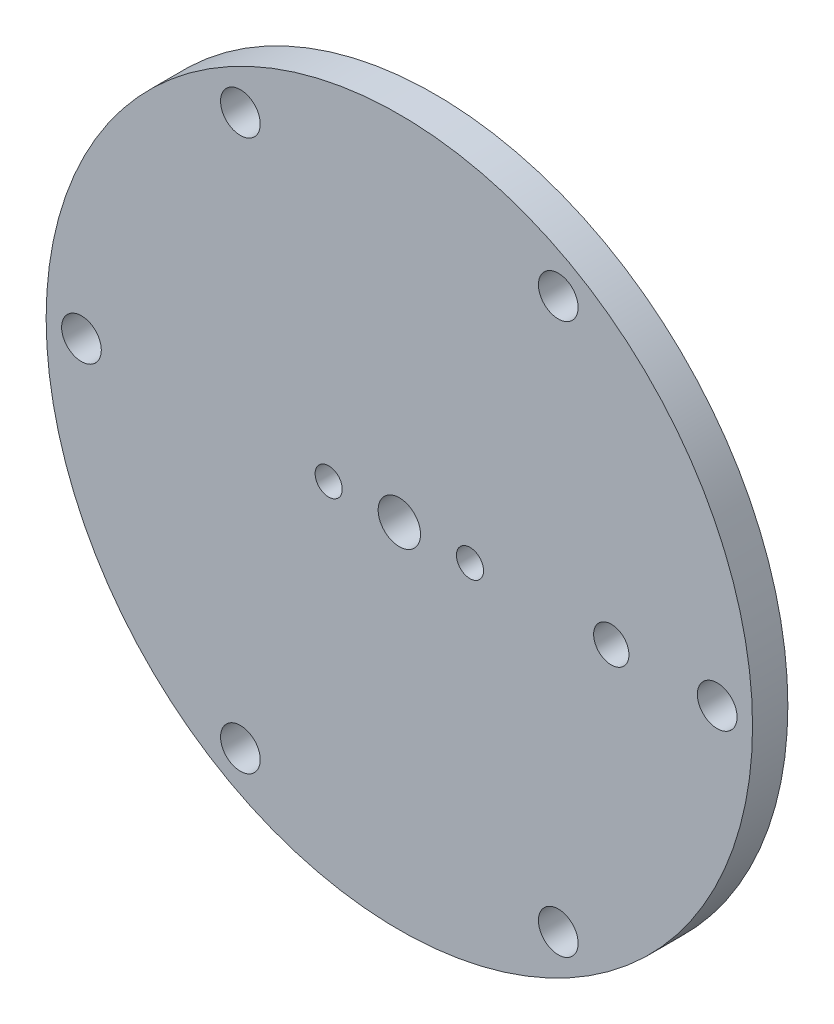
ISO-10303-21;
HEADER;
FILE_DESCRIPTION(('STEP AP214'),'2;1');
FILE_NAME('part.step','',(''),(''),'','','');
FILE_SCHEMA(('AUTOMOTIVE_DESIGN { 1 0 10303 214 1 1 1 1 }'));
ENDSEC;
DATA;
#1=APPLICATION_CONTEXT('core data for automotive mechanical design processes');
#2=APPLICATION_PROTOCOL_DEFINITION('international standard','automotive_design',2000,#1);
#3=PRODUCT_CONTEXT('',#1,'mechanical');
#4=PRODUCT('Part','Part','',(#3));
#5=PRODUCT_RELATED_PRODUCT_CATEGORY('part','',(#4));
#6=PRODUCT_DEFINITION_FORMATION('','',#4);
#7=PRODUCT_DEFINITION_CONTEXT('part definition',#1,'design');
#8=PRODUCT_DEFINITION('design','',#6,#7);
#9=PRODUCT_DEFINITION_SHAPE('','',#8);
#10=(LENGTH_UNIT() NAMED_UNIT(*) SI_UNIT(.MILLI.,.METRE.));
#11=(NAMED_UNIT(*) PLANE_ANGLE_UNIT() SI_UNIT($,.RADIAN.));
#12=(NAMED_UNIT(*) SI_UNIT($,.STERADIAN.) SOLID_ANGLE_UNIT());
#13=UNCERTAINTY_MEASURE_WITH_UNIT(LENGTH_MEASURE(1.E-05),#10,'distance_accuracy_value','');
#14=(GEOMETRIC_REPRESENTATION_CONTEXT(3) GLOBAL_UNCERTAINTY_ASSIGNED_CONTEXT((#13)) GLOBAL_UNIT_ASSIGNED_CONTEXT((#10,
#11,#12)) REPRESENTATION_CONTEXT('',''));
#15=CARTESIAN_POINT('',(0.,0.,0.));
#16=DIRECTION('',(0.,0.,1.));
#17=DIRECTION('',(1.,0.,0.));
#18=AXIS2_PLACEMENT_3D('',#15,#16,#17);
#19=CARTESIAN_POINT('',(0.,0.,3.175));
#20=DIRECTION('',(0.,0.,-1.));
#21=DIRECTION('',(-1.,0.,0.));
#22=AXIS2_PLACEMENT_3D('',#19,#20,#21);
#23=CYLINDRICAL_SURFACE('',#22,31.75);
#24=CARTESIAN_POINT('',(0.,0.,3.175));
#25=DIRECTION('',(0.,0.,1.));
#26=DIRECTION('',(1.,0.,0.));
#27=AXIS2_PLACEMENT_3D('',#24,#25,#26);
#28=CIRCLE('',#27,31.75);
#29=CARTESIAN_POINT('',(31.75,0.,3.175));
#30=VERTEX_POINT('',#29);
#31=EDGE_CURVE('E10',#30,#30,#28,.T.);
#32=ORIENTED_EDGE('',*,*,#31,.F.);
#33=EDGE_LOOP('',(#32));
#34=FACE_BOUND('',#33,.T.);
#35=CARTESIAN_POINT('',(0.,0.,0.));
#36=DIRECTION('',(0.,0.,1.));
#37=DIRECTION('',(1.,0.,0.));
#38=AXIS2_PLACEMENT_3D('',#35,#36,#37);
#39=CIRCLE('',#38,31.75);
#40=CARTESIAN_POINT('',(31.75,0.,0.));
#41=VERTEX_POINT('',#40);
#42=EDGE_CURVE('E37',#41,#41,#39,.T.);
#43=ORIENTED_EDGE('',*,*,#42,.T.);
#44=EDGE_LOOP('',(#43));
#45=FACE_BOUND('',#44,.T.);
#46=ADVANCED_FACE('F30',(#34,#45),#23,.T.);
#47=CARTESIAN_POINT('',(0.,0.,3.175));
#48=DIRECTION('',(0.,0.,1.));
#49=DIRECTION('',(1.,0.,0.));
#50=AXIS2_PLACEMENT_3D('',#47,#48,#49);
#51=PLANE('',#50);
#52=CARTESIAN_POINT('',(19.05,0.,3.175));
#53=DIRECTION('',(0.,0.,1.));
#54=DIRECTION('',(1.,0.,0.));
#55=AXIS2_PLACEMENT_3D('',#52,#53,#54);
#56=CIRCLE('',#55,1.5875);
#57=CARTESIAN_POINT('',(20.6375,0.,3.175));
#58=VERTEX_POINT('',#57);
#59=EDGE_CURVE('E237',#58,#58,#56,.T.);
#60=ORIENTED_EDGE('',*,*,#59,.F.);
#61=EDGE_LOOP('',(#60));
#62=FACE_BOUND('',#61,.T.);
#63=CARTESIAN_POINT('',(-6.35,0.,3.175));
#64=DIRECTION('',(0.,0.,-1.));
#65=DIRECTION('',(-1.,0.,0.));
#66=AXIS2_PLACEMENT_3D('',#63,#64,#65);
#67=CIRCLE('',#66,1.2192);
#68=CARTESIAN_POINT('',(-7.5692,0.,3.175));
#69=VERTEX_POINT('',#68);
#70=EDGE_CURVE('E247',#69,#69,#67,.T.);
#71=ORIENTED_EDGE('',*,*,#70,.T.);
#72=EDGE_LOOP('',(#71));
#73=FACE_BOUND('',#72,.T.);
#74=CARTESIAN_POINT('',(6.35,0.,3.175));
#75=DIRECTION('',(0.,0.,-1.));
#76=DIRECTION('',(-1.,0.,0.));
#77=AXIS2_PLACEMENT_3D('',#74,#75,#76);
#78=CIRCLE('',#77,1.2192);
#79=CARTESIAN_POINT('',(5.1308,0.,3.175));
#80=VERTEX_POINT('',#79);
#81=EDGE_CURVE('E256',#80,#80,#78,.T.);
#82=ORIENTED_EDGE('',*,*,#81,.T.);
#83=EDGE_LOOP('',(#82));
#84=FACE_BOUND('',#83,.T.);
#85=CARTESIAN_POINT('',(0.,0.,3.175));
#86=DIRECTION('',(0.,0.,1.));
#87=DIRECTION('',(1.,0.,0.));
#88=AXIS2_PLACEMENT_3D('',#85,#86,#87);
#89=CIRCLE('',#88,1.905);
#90=CARTESIAN_POINT('',(1.905,0.,3.175));
#91=VERTEX_POINT('',#90);
#92=EDGE_CURVE('E259',#91,#91,#89,.T.);
#93=ORIENTED_EDGE('',*,*,#92,.F.);
#94=EDGE_LOOP('',(#93));
#95=FACE_BOUND('',#94,.T.);
#96=CARTESIAN_POINT('',(-14.2874999999998,24.7466759131405,3.175));
#97=DIRECTION('',(0.,0.,1.));
#98=DIRECTION('',(1.,0.,0.));
#99=AXIS2_PLACEMENT_3D('',#96,#97,#98);
#100=CIRCLE('',#99,1.78435);
#101=CARTESIAN_POINT('',(-12.5031499999998,24.7466759131405,3.175));
#102=VERTEX_POINT('',#101);
#103=EDGE_CURVE('E263',#102,#102,#100,.T.);
#104=ORIENTED_EDGE('',*,*,#103,.F.);
#105=EDGE_LOOP('',(#104));
#106=FACE_BOUND('',#105,.T.);
#107=CARTESIAN_POINT('',(-28.575,1.89084858881472E-13,3.175));
#108=DIRECTION('',(0.,0.,1.));
#109=DIRECTION('',(1.,0.,0.));
#110=AXIS2_PLACEMENT_3D('',#107,#108,#109);
#111=CIRCLE('',#110,1.78435);
#112=CARTESIAN_POINT('',(-26.79065,1.89084858881472E-13,3.175));
#113=VERTEX_POINT('',#112);
#114=EDGE_CURVE('E69',#113,#113,#111,.T.);
#115=ORIENTED_EDGE('',*,*,#114,.F.);
#116=EDGE_LOOP('',(#115));
#117=FACE_BOUND('',#116,.T.);
#118=CARTESIAN_POINT('',(-14.2874999999999,-24.7466759131404,3.175));
#119=DIRECTION('',(0.,0.,1.));
#120=DIRECTION('',(1.,0.,0.));
#121=AXIS2_PLACEMENT_3D('',#118,#119,#120);
#122=CIRCLE('',#121,1.78435);
#123=CARTESIAN_POINT('',(-12.5031499999999,-24.7466759131404,3.175));
#124=VERTEX_POINT('',#123);
#125=EDGE_CURVE('E59',#124,#124,#122,.T.);
#126=ORIENTED_EDGE('',*,*,#125,.F.);
#127=EDGE_LOOP('',(#126));
#128=FACE_BOUND('',#127,.T.);
#129=CARTESIAN_POINT('',(14.2875,-24.7466759131404,3.175));
#130=DIRECTION('',(0.,0.,1.));
#131=DIRECTION('',(1.,0.,0.));
#132=AXIS2_PLACEMENT_3D('',#129,#130,#131);
#133=CIRCLE('',#132,1.78435);
#134=CARTESIAN_POINT('',(16.07185,-24.7466759131404,3.175));
#135=VERTEX_POINT('',#134);
#136=EDGE_CURVE('E56',#135,#135,#133,.T.);
#137=ORIENTED_EDGE('',*,*,#136,.F.);
#138=EDGE_LOOP('',(#137));
#139=FACE_BOUND('',#138,.T.);
#140=CARTESIAN_POINT('',(28.575,0.,3.175));
#141=DIRECTION('',(0.,0.,1.));
#142=DIRECTION('',(1.,0.,0.));
#143=AXIS2_PLACEMENT_3D('',#140,#141,#142);
#144=CIRCLE('',#143,1.78435);
#145=CARTESIAN_POINT('',(30.35935,0.,3.175));
#146=VERTEX_POINT('',#145);
#147=EDGE_CURVE('E53',#146,#146,#144,.T.);
#148=ORIENTED_EDGE('',*,*,#147,.F.);
#149=EDGE_LOOP('',(#148));
#150=FACE_BOUND('',#149,.T.);
#151=CARTESIAN_POINT('',(14.2874999999999,24.7466759131404,3.175));
#152=DIRECTION('',(0.,0.,1.));
#153=DIRECTION('',(1.,0.,0.));
#154=AXIS2_PLACEMENT_3D('',#151,#152,#153);
#155=CIRCLE('',#154,1.78435);
#156=CARTESIAN_POINT('',(16.0718499999999,24.7466759131404,3.175));
#157=VERTEX_POINT('',#156);
#158=EDGE_CURVE('E45',#157,#157,#155,.T.);
#159=ORIENTED_EDGE('',*,*,#158,.F.);
#160=EDGE_LOOP('',(#159));
#161=FACE_BOUND('',#160,.T.);
#162=ORIENTED_EDGE('',*,*,#31,.T.);
#163=EDGE_LOOP('',(#162));
#164=FACE_BOUND('',#163,.T.);
#165=ADVANCED_FACE('F78',(#62,#73,#84,#95,#106,#117,#128,#139,#150,#161,#164),#51,.T.);
#166=CARTESIAN_POINT('',(0.,0.,0.));
#167=DIRECTION('',(0.,0.,1.));
#168=DIRECTION('',(1.,0.,0.));
#169=AXIS2_PLACEMENT_3D('',#166,#167,#168);
#170=PLANE('',#169);
#171=CARTESIAN_POINT('',(19.05,0.,0.));
#172=DIRECTION('',(0.,0.,1.));
#173=DIRECTION('',(1.,0.,0.));
#174=AXIS2_PLACEMENT_3D('',#171,#172,#173);
#175=CIRCLE('',#174,1.5875);
#176=CARTESIAN_POINT('',(20.6375,0.,0.));
#177=VERTEX_POINT('',#176);
#178=EDGE_CURVE('E234',#177,#177,#175,.T.);
#179=ORIENTED_EDGE('',*,*,#178,.T.);
#180=EDGE_LOOP('',(#179));
#181=FACE_BOUND('',#180,.T.);
#182=CARTESIAN_POINT('',(-6.35,0.,0.));
#183=DIRECTION('',(0.,0.,-1.));
#184=DIRECTION('',(-1.,0.,0.));
#185=AXIS2_PLACEMENT_3D('',#182,#183,#184);
#186=CIRCLE('',#185,2.1844);
#187=CARTESIAN_POINT('',(-8.5344,0.,0.));
#188=VERTEX_POINT('',#187);
#189=EDGE_CURVE('E239',#188,#188,#186,.T.);
#190=ORIENTED_EDGE('',*,*,#189,.F.);
#191=EDGE_LOOP('',(#190));
#192=FACE_BOUND('',#191,.T.);
#193=CARTESIAN_POINT('',(6.35,0.,0.));
#194=DIRECTION('',(0.,0.,-1.));
#195=DIRECTION('',(-1.,0.,0.));
#196=AXIS2_PLACEMENT_3D('',#193,#194,#195);
#197=CIRCLE('',#196,2.1844);
#198=CARTESIAN_POINT('',(4.1656,0.,0.));
#199=VERTEX_POINT('',#198);
#200=EDGE_CURVE('E250',#199,#199,#197,.T.);
#201=ORIENTED_EDGE('',*,*,#200,.F.);
#202=EDGE_LOOP('',(#201));
#203=FACE_BOUND('',#202,.T.);
#204=CARTESIAN_POINT('',(0.,0.,0.));
#205=DIRECTION('',(0.,0.,1.));
#206=DIRECTION('',(1.,0.,0.));
#207=AXIS2_PLACEMENT_3D('',#204,#205,#206);
#208=CIRCLE('',#207,1.905);
#209=CARTESIAN_POINT('',(1.905,0.,0.));
#210=VERTEX_POINT('',#209);
#211=EDGE_CURVE('E260',#210,#210,#208,.T.);
#212=ORIENTED_EDGE('',*,*,#211,.T.);
#213=EDGE_LOOP('',(#212));
#214=FACE_BOUND('',#213,.T.);
#215=CARTESIAN_POINT('',(-14.2874999999998,24.7466759131405,0.));
#216=DIRECTION('',(0.,0.,1.));
#217=DIRECTION('',(1.,0.,0.));
#218=AXIS2_PLACEMENT_3D('',#215,#216,#217);
#219=CIRCLE('',#218,1.78435);
#220=CARTESIAN_POINT('',(-12.5031499999998,24.7466759131405,0.));
#221=VERTEX_POINT('',#220);
#222=EDGE_CURVE('E267',#221,#221,#219,.T.);
#223=ORIENTED_EDGE('',*,*,#222,.T.);
#224=EDGE_LOOP('',(#223));
#225=FACE_BOUND('',#224,.T.);
#226=CARTESIAN_POINT('',(-28.575,1.89084858881472E-13,0.));
#227=DIRECTION('',(0.,0.,1.));
#228=DIRECTION('',(1.,0.,0.));
#229=AXIS2_PLACEMENT_3D('',#226,#227,#228);
#230=CIRCLE('',#229,1.78435);
#231=CARTESIAN_POINT('',(-26.79065,1.89084858881472E-13,0.));
#232=VERTEX_POINT('',#231);
#233=EDGE_CURVE('E33',#232,#232,#230,.T.);
#234=ORIENTED_EDGE('',*,*,#233,.T.);
#235=EDGE_LOOP('',(#234));
#236=FACE_BOUND('',#235,.T.);
#237=CARTESIAN_POINT('',(-14.2874999999999,-24.7466759131404,0.));
#238=DIRECTION('',(0.,0.,1.));
#239=DIRECTION('',(1.,0.,0.));
#240=AXIS2_PLACEMENT_3D('',#237,#238,#239);
#241=CIRCLE('',#240,1.78435);
#242=CARTESIAN_POINT('',(-12.5031499999999,-24.7466759131404,0.));
#243=VERTEX_POINT('',#242);
#244=EDGE_CURVE('E57',#243,#243,#241,.T.);
#245=ORIENTED_EDGE('',*,*,#244,.T.);
#246=EDGE_LOOP('',(#245));
#247=FACE_BOUND('',#246,.T.);
#248=CARTESIAN_POINT('',(14.2875,-24.7466759131404,0.));
#249=DIRECTION('',(0.,0.,1.));
#250=DIRECTION('',(1.,0.,0.));
#251=AXIS2_PLACEMENT_3D('',#248,#249,#250);
#252=CIRCLE('',#251,1.78435);
#253=CARTESIAN_POINT('',(16.07185,-24.7466759131404,0.));
#254=VERTEX_POINT('',#253);
#255=EDGE_CURVE('E54',#254,#254,#252,.T.);
#256=ORIENTED_EDGE('',*,*,#255,.T.);
#257=EDGE_LOOP('',(#256));
#258=FACE_BOUND('',#257,.T.);
#259=CARTESIAN_POINT('',(28.575,0.,0.));
#260=DIRECTION('',(0.,0.,1.));
#261=DIRECTION('',(1.,0.,0.));
#262=AXIS2_PLACEMENT_3D('',#259,#260,#261);
#263=CIRCLE('',#262,1.78435);
#264=CARTESIAN_POINT('',(30.35935,0.,0.));
#265=VERTEX_POINT('',#264);
#266=EDGE_CURVE('E50',#265,#265,#263,.T.);
#267=ORIENTED_EDGE('',*,*,#266,.T.);
#268=EDGE_LOOP('',(#267));
#269=FACE_BOUND('',#268,.T.);
#270=CARTESIAN_POINT('',(14.2874999999999,24.7466759131404,0.));
#271=DIRECTION('',(0.,0.,1.));
#272=DIRECTION('',(1.,0.,0.));
#273=AXIS2_PLACEMENT_3D('',#270,#271,#272);
#274=CIRCLE('',#273,1.78435);
#275=CARTESIAN_POINT('',(16.0718499999999,24.7466759131404,0.));
#276=VERTEX_POINT('',#275);
#277=EDGE_CURVE('E42',#276,#276,#274,.T.);
#278=ORIENTED_EDGE('',*,*,#277,.T.);
#279=EDGE_LOOP('',(#278));
#280=FACE_BOUND('',#279,.T.);
#281=ORIENTED_EDGE('',*,*,#42,.F.);
#282=EDGE_LOOP('',(#281));
#283=FACE_BOUND('',#282,.T.);
#284=ADVANCED_FACE('F81',(#181,#192,#203,#214,#225,#236,#247,#258,#269,#280,#283),#170,.F.);
#285=CARTESIAN_POINT('',(14.2874999999999,24.7466759131404,3.175));
#286=DIRECTION('',(0.,0.,1.));
#287=DIRECTION('',(1.,0.,0.));
#288=AXIS2_PLACEMENT_3D('',#285,#286,#287);
#289=CYLINDRICAL_SURFACE('',#288,1.78435);
#290=ORIENTED_EDGE('',*,*,#158,.T.);
#291=EDGE_LOOP('',(#290));
#292=FACE_BOUND('',#291,.T.);
#293=ORIENTED_EDGE('',*,*,#277,.F.);
#294=EDGE_LOOP('',(#293));
#295=FACE_BOUND('',#294,.T.);
#296=ADVANCED_FACE('F87',(#292,#295),#289,.F.);
#297=CARTESIAN_POINT('',(28.575,0.,3.175));
#298=DIRECTION('',(0.,0.,1.));
#299=DIRECTION('',(1.,0.,0.));
#300=AXIS2_PLACEMENT_3D('',#297,#298,#299);
#301=CYLINDRICAL_SURFACE('',#300,1.78435);
#302=ORIENTED_EDGE('',*,*,#147,.T.);
#303=EDGE_LOOP('',(#302));
#304=FACE_BOUND('',#303,.T.);
#305=ORIENTED_EDGE('',*,*,#266,.F.);
#306=EDGE_LOOP('',(#305));
#307=FACE_BOUND('',#306,.T.);
#308=ADVANCED_FACE('F75',(#304,#307),#301,.F.);
#309=CARTESIAN_POINT('',(14.2875,-24.7466759131404,3.175));
#310=DIRECTION('',(0.,0.,1.));
#311=DIRECTION('',(1.,0.,0.));
#312=AXIS2_PLACEMENT_3D('',#309,#310,#311);
#313=CYLINDRICAL_SURFACE('',#312,1.78435);
#314=ORIENTED_EDGE('',*,*,#136,.T.);
#315=EDGE_LOOP('',(#314));
#316=FACE_BOUND('',#315,.T.);
#317=ORIENTED_EDGE('',*,*,#255,.F.);
#318=EDGE_LOOP('',(#317));
#319=FACE_BOUND('',#318,.T.);
#320=ADVANCED_FACE('F122',(#316,#319),#313,.F.);
#321=CARTESIAN_POINT('',(-14.2874999999999,-24.7466759131404,3.175));
#322=DIRECTION('',(0.,0.,1.));
#323=DIRECTION('',(1.,0.,0.));
#324=AXIS2_PLACEMENT_3D('',#321,#322,#323);
#325=CYLINDRICAL_SURFACE('',#324,1.78435);
#326=ORIENTED_EDGE('',*,*,#125,.T.);
#327=EDGE_LOOP('',(#326));
#328=FACE_BOUND('',#327,.T.);
#329=ORIENTED_EDGE('',*,*,#244,.F.);
#330=EDGE_LOOP('',(#329));
#331=FACE_BOUND('',#330,.T.);
#332=ADVANCED_FACE('F129',(#328,#331),#325,.F.);
#333=CARTESIAN_POINT('',(-28.575,1.89084858881472E-13,3.175));
#334=DIRECTION('',(0.,0.,1.));
#335=DIRECTION('',(1.,0.,0.));
#336=AXIS2_PLACEMENT_3D('',#333,#334,#335);
#337=CYLINDRICAL_SURFACE('',#336,1.78435);
#338=ORIENTED_EDGE('',*,*,#114,.T.);
#339=EDGE_LOOP('',(#338));
#340=FACE_BOUND('',#339,.T.);
#341=ORIENTED_EDGE('',*,*,#233,.F.);
#342=EDGE_LOOP('',(#341));
#343=FACE_BOUND('',#342,.T.);
#344=ADVANCED_FACE('F137',(#340,#343),#337,.F.);
#345=CARTESIAN_POINT('',(-14.2874999999998,24.7466759131405,3.175));
#346=DIRECTION('',(0.,0.,1.));
#347=DIRECTION('',(1.,0.,0.));
#348=AXIS2_PLACEMENT_3D('',#345,#346,#347);
#349=CYLINDRICAL_SURFACE('',#348,1.78435);
#350=ORIENTED_EDGE('',*,*,#103,.T.);
#351=EDGE_LOOP('',(#350));
#352=FACE_BOUND('',#351,.T.);
#353=ORIENTED_EDGE('',*,*,#222,.F.);
#354=EDGE_LOOP('',(#353));
#355=FACE_BOUND('',#354,.T.);
#356=ADVANCED_FACE('F144',(#352,#355),#349,.F.);
#357=CARTESIAN_POINT('',(0.,0.,0.));
#358=DIRECTION('',(0.,0.,1.));
#359=DIRECTION('',(1.,0.,0.));
#360=AXIS2_PLACEMENT_3D('',#357,#358,#359);
#361=CYLINDRICAL_SURFACE('',#360,1.905);
#362=ORIENTED_EDGE('',*,*,#211,.F.);
#363=EDGE_LOOP('',(#362));
#364=FACE_BOUND('',#363,.T.);
#365=ORIENTED_EDGE('',*,*,#92,.T.);
#366=EDGE_LOOP('',(#365));
#367=FACE_BOUND('',#366,.T.);
#368=ADVANCED_FACE('F152',(#364,#367),#361,.F.);
#369=CARTESIAN_POINT('',(6.35,0.,0.));
#370=DIRECTION('',(0.,0.,-1.));
#371=DIRECTION('',(-1.,0.,0.));
#372=AXIS2_PLACEMENT_3D('',#369,#370,#371);
#373=CYLINDRICAL_SURFACE('',#372,1.2192);
#374=ORIENTED_EDGE('',*,*,#81,.F.);
#375=EDGE_LOOP('',(#374));
#376=FACE_BOUND('',#375,.T.);
#377=CARTESIAN_POINT('',(6.35,0.,0.80989896401231));
#378=DIRECTION('',(0.,0.,-1.));
#379=DIRECTION('',(-1.,0.,0.));
#380=AXIS2_PLACEMENT_3D('',#377,#378,#379);
#381=CIRCLE('',#380,1.2192);
#382=CARTESIAN_POINT('',(5.1308,0.,0.80989896401231));
#383=VERTEX_POINT('',#382);
#384=EDGE_CURVE('E253',#383,#383,#381,.T.);
#385=ORIENTED_EDGE('',*,*,#384,.T.);
#386=EDGE_LOOP('',(#385));
#387=FACE_BOUND('',#386,.T.);
#388=ADVANCED_FACE('F160',(#376,#387),#373,.F.);
#389=CARTESIAN_POINT('',(6.35,0.,0.));
#390=DIRECTION('',(0.,0.,-1.));
#391=DIRECTION('',(-1.,0.,0.));
#392=AXIS2_PLACEMENT_3D('',#389,#390,#391);
#393=CONICAL_SURFACE('',#392,2.1844,0.872664625997165);
#394=ORIENTED_EDGE('',*,*,#384,.F.);
#395=EDGE_LOOP('',(#394));
#396=FACE_BOUND('',#395,.T.);
#397=ORIENTED_EDGE('',*,*,#200,.T.);
#398=EDGE_LOOP('',(#397));
#399=FACE_BOUND('',#398,.T.);
#400=ADVANCED_FACE('F168',(#396,#399),#393,.F.);
#401=CARTESIAN_POINT('',(-6.35,0.,0.));
#402=DIRECTION('',(0.,0.,-1.));
#403=DIRECTION('',(-1.,0.,0.));
#404=AXIS2_PLACEMENT_3D('',#401,#402,#403);
#405=CYLINDRICAL_SURFACE('',#404,1.2192);
#406=ORIENTED_EDGE('',*,*,#70,.F.);
#407=EDGE_LOOP('',(#406));
#408=FACE_BOUND('',#407,.T.);
#409=CARTESIAN_POINT('',(-6.35,0.,0.80989896401231));
#410=DIRECTION('',(0.,0.,-1.));
#411=DIRECTION('',(-1.,0.,0.));
#412=AXIS2_PLACEMENT_3D('',#409,#410,#411);
#413=CIRCLE('',#412,1.2192);
#414=CARTESIAN_POINT('',(-7.5692,0.,0.80989896401231));
#415=VERTEX_POINT('',#414);
#416=EDGE_CURVE('E244',#415,#415,#413,.T.);
#417=ORIENTED_EDGE('',*,*,#416,.T.);
#418=EDGE_LOOP('',(#417));
#419=FACE_BOUND('',#418,.T.);
#420=ADVANCED_FACE('F176',(#408,#419),#405,.F.);
#421=CARTESIAN_POINT('',(-6.35,0.,0.));
#422=DIRECTION('',(0.,0.,-1.));
#423=DIRECTION('',(-1.,0.,0.));
#424=AXIS2_PLACEMENT_3D('',#421,#422,#423);
#425=CONICAL_SURFACE('',#424,2.1844,0.872664625997165);
#426=ORIENTED_EDGE('',*,*,#416,.F.);
#427=EDGE_LOOP('',(#426));
#428=FACE_BOUND('',#427,.T.);
#429=ORIENTED_EDGE('',*,*,#189,.T.);
#430=EDGE_LOOP('',(#429));
#431=FACE_BOUND('',#430,.T.);
#432=ADVANCED_FACE('F184',(#428,#431),#425,.F.);
#433=CARTESIAN_POINT('',(19.05,0.,0.));
#434=DIRECTION('',(0.,0.,1.));
#435=DIRECTION('',(1.,0.,0.));
#436=AXIS2_PLACEMENT_3D('',#433,#434,#435);
#437=CYLINDRICAL_SURFACE('',#436,1.5875);
#438=ORIENTED_EDGE('',*,*,#178,.F.);
#439=EDGE_LOOP('',(#438));
#440=FACE_BOUND('',#439,.T.);
#441=ORIENTED_EDGE('',*,*,#59,.T.);
#442=EDGE_LOOP('',(#441));
#443=FACE_BOUND('',#442,.T.);
#444=ADVANCED_FACE('F191',(#440,#443),#437,.F.);
#445=CLOSED_SHELL('',(#46,#165,#284,#296,#308,#320,#332,#344,#356,#368,#388,#400,#420,#432,#444));
#446=MANIFOLD_SOLID_BREP('B2',#445);
#447=ADVANCED_BREP_SHAPE_REPRESENTATION('',(#18,#446),#14);
#448=SHAPE_DEFINITION_REPRESENTATION(#9,#447);
ENDSEC;
END-ISO-10303-21;
